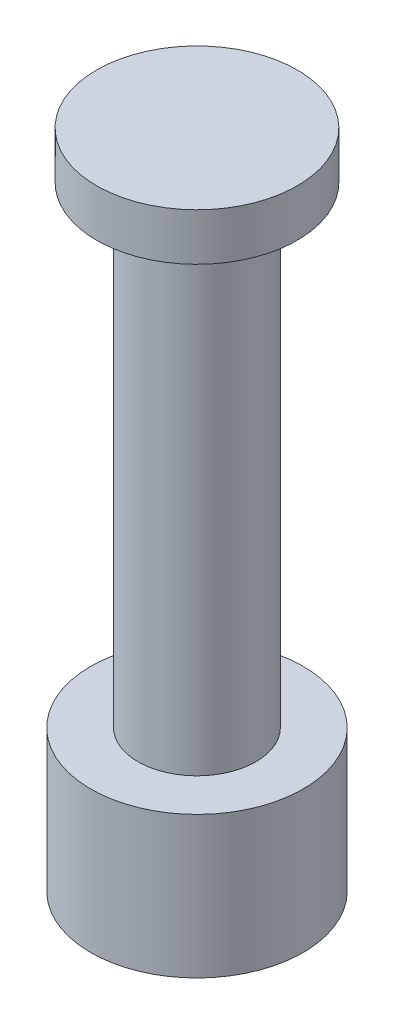
ISO-10303-21;
HEADER;
FILE_DESCRIPTION(('STEP AP214'),'2;1');
FILE_NAME('part.step','',(''),(''),'','','');
FILE_SCHEMA(('AUTOMOTIVE_DESIGN { 1 0 10303 214 1 1 1 1 }'));
ENDSEC;
DATA;
#1=APPLICATION_CONTEXT('core data for automotive mechanical design processes');
#2=APPLICATION_PROTOCOL_DEFINITION('international standard','automotive_design',2000,#1);
#3=PRODUCT_CONTEXT('',#1,'mechanical');
#4=PRODUCT('Part','Part','',(#3));
#5=PRODUCT_RELATED_PRODUCT_CATEGORY('part','',(#4));
#6=PRODUCT_DEFINITION_FORMATION('','',#4);
#7=PRODUCT_DEFINITION_CONTEXT('part definition',#1,'design');
#8=PRODUCT_DEFINITION('design','',#6,#7);
#9=PRODUCT_DEFINITION_SHAPE('','',#8);
#10=(LENGTH_UNIT() NAMED_UNIT(*) SI_UNIT(.MILLI.,.METRE.));
#11=(NAMED_UNIT(*) PLANE_ANGLE_UNIT() SI_UNIT($,.RADIAN.));
#12=(NAMED_UNIT(*) SI_UNIT($,.STERADIAN.) SOLID_ANGLE_UNIT());
#13=UNCERTAINTY_MEASURE_WITH_UNIT(LENGTH_MEASURE(1.E-05),#10,'distance_accuracy_value','');
#14=(GEOMETRIC_REPRESENTATION_CONTEXT(3) GLOBAL_UNCERTAINTY_ASSIGNED_CONTEXT((#13)) GLOBAL_UNIT_ASSIGNED_CONTEXT((#10,
#11,#12)) REPRESENTATION_CONTEXT('',''));
#15=CARTESIAN_POINT('',(0.,0.,0.));
#16=DIRECTION('',(0.,0.,1.));
#17=DIRECTION('',(1.,0.,0.));
#18=AXIS2_PLACEMENT_3D('',#15,#16,#17);
#19=CARTESIAN_POINT('',(0.,14.,0.));
#20=DIRECTION('',(0.,-1.,0.));
#21=DIRECTION('',(1.,0.,0.));
#22=AXIS2_PLACEMENT_3D('',#19,#20,#21);
#23=PLANE('',#22);
#24=CARTESIAN_POINT('',(0.,14.,0.));
#25=DIRECTION('',(0.,1.,0.));
#26=DIRECTION('',(-1.,0.,0.));
#27=AXIS2_PLACEMENT_3D('',#24,#25,#26);
#28=CIRCLE('',#27,4.25);
#29=CARTESIAN_POINT('',(-4.25000000000001,14.,0.));
#30=VERTEX_POINT('',#29);
#31=EDGE_CURVE('E10',#30,#30,#28,.T.);
#32=ORIENTED_EDGE('',*,*,#31,.T.);
#33=EDGE_LOOP('',(#32));
#34=FACE_BOUND('',#33,.T.);
#35=ADVANCED_FACE('F33',(#34),#23,.F.);
#36=CARTESIAN_POINT('',(0.,14.,0.));
#37=DIRECTION('',(0.,1.,0.));
#38=DIRECTION('',(-1.,0.,0.));
#39=AXIS2_PLACEMENT_3D('',#36,#37,#38);
#40=CYLINDRICAL_SURFACE('',#39,4.25);
#41=ORIENTED_EDGE('',*,*,#31,.F.);
#42=EDGE_LOOP('',(#41));
#43=FACE_BOUND('',#42,.T.);
#44=CARTESIAN_POINT('',(0.,12.,0.));
#45=DIRECTION('',(0.,1.,0.));
#46=DIRECTION('',(-1.,0.,0.));
#47=AXIS2_PLACEMENT_3D('',#44,#45,#46);
#48=CIRCLE('',#47,4.25);
#49=CARTESIAN_POINT('',(-4.25,12.,0.));
#50=VERTEX_POINT('',#49);
#51=EDGE_CURVE('E39',#50,#50,#48,.T.);
#52=ORIENTED_EDGE('',*,*,#51,.T.);
#53=EDGE_LOOP('',(#52));
#54=FACE_BOUND('',#53,.T.);
#55=ADVANCED_FACE('F71',(#43,#54),#40,.T.);
#56=CARTESIAN_POINT('',(4.25,12.,0.));
#57=DIRECTION('',(0.,1.,0.));
#58=DIRECTION('',(-1.,0.,0.));
#59=AXIS2_PLACEMENT_3D('',#56,#57,#58);
#60=PLANE('',#59);
#61=ORIENTED_EDGE('',*,*,#51,.F.);
#62=EDGE_LOOP('',(#61));
#63=FACE_BOUND('',#62,.T.);
#64=CARTESIAN_POINT('',(0.,12.,0.));
#65=DIRECTION('',(0.,1.,0.));
#66=DIRECTION('',(-1.,0.,0.));
#67=AXIS2_PLACEMENT_3D('',#64,#65,#66);
#68=CIRCLE('',#67,2.5);
#69=CARTESIAN_POINT('',(-2.5,12.,0.));
#70=VERTEX_POINT('',#69);
#71=EDGE_CURVE('E43',#70,#70,#68,.T.);
#72=ORIENTED_EDGE('',*,*,#71,.T.);
#73=EDGE_LOOP('',(#72));
#74=FACE_BOUND('',#73,.T.);
#75=ADVANCED_FACE('F75',(#63,#74),#60,.F.);
#76=CARTESIAN_POINT('',(0.,14.,0.));
#77=DIRECTION('',(0.,1.,0.));
#78=DIRECTION('',(-1.,0.,0.));
#79=AXIS2_PLACEMENT_3D('',#76,#77,#78);
#80=CYLINDRICAL_SURFACE('',#79,2.5);
#81=ORIENTED_EDGE('',*,*,#71,.F.);
#82=EDGE_LOOP('',(#81));
#83=FACE_BOUND('',#82,.T.);
#84=CARTESIAN_POINT('',(0.,-8.,0.));
#85=DIRECTION('',(0.,1.,0.));
#86=DIRECTION('',(-1.,0.,0.));
#87=AXIS2_PLACEMENT_3D('',#84,#85,#86);
#88=CIRCLE('',#87,2.5);
#89=CARTESIAN_POINT('',(-2.50000000000001,-8.,0.));
#90=VERTEX_POINT('',#89);
#91=EDGE_CURVE('E47',#90,#90,#88,.T.);
#92=ORIENTED_EDGE('',*,*,#91,.T.);
#93=EDGE_LOOP('',(#92));
#94=FACE_BOUND('',#93,.T.);
#95=ADVANCED_FACE('F80',(#83,#94),#80,.T.);
#96=CARTESIAN_POINT('',(2.5,-8.,0.));
#97=DIRECTION('',(0.,-1.,0.));
#98=DIRECTION('',(1.,0.,0.));
#99=AXIS2_PLACEMENT_3D('',#96,#97,#98);
#100=PLANE('',#99);
#101=ORIENTED_EDGE('',*,*,#91,.F.);
#102=EDGE_LOOP('',(#101));
#103=FACE_BOUND('',#102,.T.);
#104=CARTESIAN_POINT('',(0.,-8.,0.));
#105=DIRECTION('',(0.,1.,0.));
#106=DIRECTION('',(-1.,0.,0.));
#107=AXIS2_PLACEMENT_3D('',#104,#105,#106);
#108=CIRCLE('',#107,4.5);
#109=CARTESIAN_POINT('',(-4.5,-8.,0.));
#110=VERTEX_POINT('',#109);
#111=EDGE_CURVE('E52',#110,#110,#108,.T.);
#112=ORIENTED_EDGE('',*,*,#111,.T.);
#113=EDGE_LOOP('',(#112));
#114=FACE_BOUND('',#113,.T.);
#115=ADVANCED_FACE('F67',(#103,#114),#100,.F.);
#116=CARTESIAN_POINT('',(0.,14.,0.));
#117=DIRECTION('',(0.,1.,0.));
#118=DIRECTION('',(-1.,0.,0.));
#119=AXIS2_PLACEMENT_3D('',#116,#117,#118);
#120=CYLINDRICAL_SURFACE('',#119,4.5);
#121=ORIENTED_EDGE('',*,*,#111,.F.);
#122=EDGE_LOOP('',(#121));
#123=FACE_BOUND('',#122,.T.);
#124=CARTESIAN_POINT('',(0.,-14.,0.));
#125=DIRECTION('',(0.,1.,0.));
#126=DIRECTION('',(-1.,0.,0.));
#127=AXIS2_PLACEMENT_3D('',#124,#125,#126);
#128=CIRCLE('',#127,4.5);
#129=CARTESIAN_POINT('',(-4.5,-14.,0.));
#130=VERTEX_POINT('',#129);
#131=EDGE_CURVE('E55',#130,#130,#128,.T.);
#132=ORIENTED_EDGE('',*,*,#131,.T.);
#133=EDGE_LOOP('',(#132));
#134=FACE_BOUND('',#133,.T.);
#135=ADVANCED_FACE('F59',(#123,#134),#120,.T.);
#136=CARTESIAN_POINT('',(4.5,-14.,0.));
#137=DIRECTION('',(0.,1.,0.));
#138=DIRECTION('',(-1.,0.,0.));
#139=AXIS2_PLACEMENT_3D('',#136,#137,#138);
#140=PLANE('',#139);
#141=ORIENTED_EDGE('',*,*,#131,.F.);
#142=EDGE_LOOP('',(#141));
#143=FACE_BOUND('',#142,.T.);
#144=ADVANCED_FACE('F61',(#143),#140,.F.);
#145=CLOSED_SHELL('',(#35,#55,#75,#95,#115,#135,#144));
#146=MANIFOLD_SOLID_BREP('B2',#145);
#147=ADVANCED_BREP_SHAPE_REPRESENTATION('',(#18,#146),#14);
#148=SHAPE_DEFINITION_REPRESENTATION(#9,#147);
ENDSEC;
END-ISO-10303-21;
